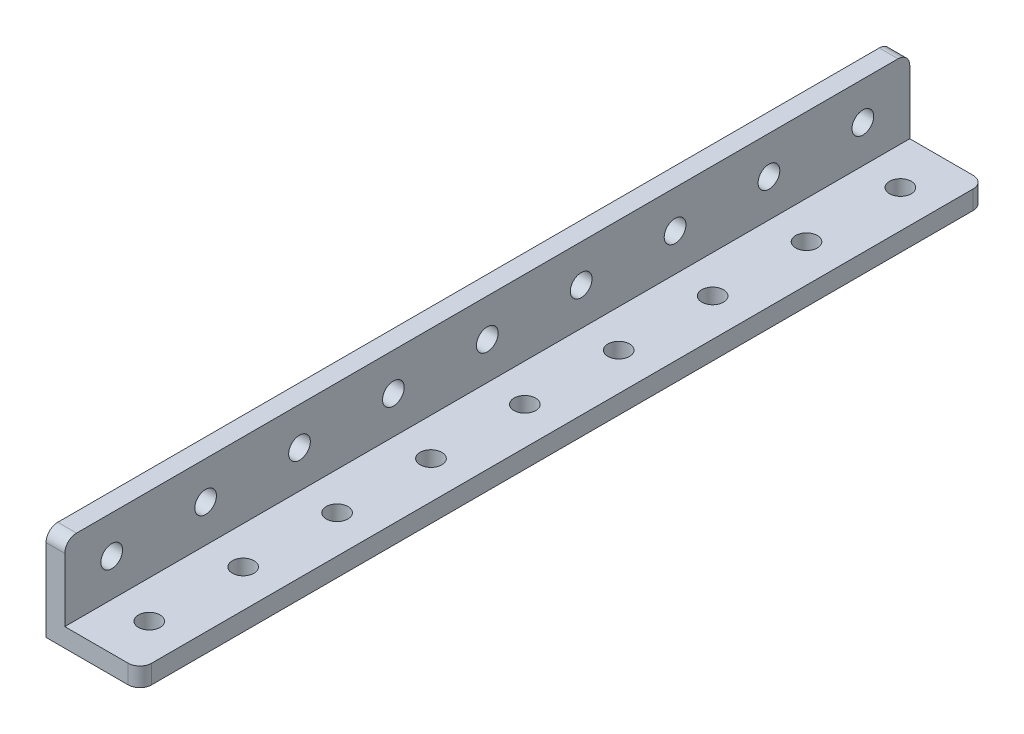
ISO-10303-21;
HEADER;
FILE_DESCRIPTION(('STEP AP214'),'2;1');
FILE_NAME('part.step','',(''),(''),'','','');
FILE_SCHEMA(('AUTOMOTIVE_DESIGN { 1 0 10303 214 1 1 1 1 }'));
ENDSEC;
DATA;
#1=APPLICATION_CONTEXT('core data for automotive mechanical design processes');
#2=APPLICATION_PROTOCOL_DEFINITION('international standard','automotive_design',2000,#1);
#3=PRODUCT_CONTEXT('',#1,'mechanical');
#4=PRODUCT('Part','Part','',(#3));
#5=PRODUCT_RELATED_PRODUCT_CATEGORY('part','',(#4));
#6=PRODUCT_DEFINITION_FORMATION('','',#4);
#7=PRODUCT_DEFINITION_CONTEXT('part definition',#1,'design');
#8=PRODUCT_DEFINITION('design','',#6,#7);
#9=PRODUCT_DEFINITION_SHAPE('','',#8);
#10=(LENGTH_UNIT() NAMED_UNIT(*) SI_UNIT(.MILLI.,.METRE.));
#11=(NAMED_UNIT(*) PLANE_ANGLE_UNIT() SI_UNIT($,.RADIAN.));
#12=(NAMED_UNIT(*) SI_UNIT($,.STERADIAN.) SOLID_ANGLE_UNIT());
#13=UNCERTAINTY_MEASURE_WITH_UNIT(LENGTH_MEASURE(1.E-05),#10,'distance_accuracy_value','');
#14=(GEOMETRIC_REPRESENTATION_CONTEXT(3) GLOBAL_UNCERTAINTY_ASSIGNED_CONTEXT((#13)) GLOBAL_UNIT_ASSIGNED_CONTEXT((#10,
#11,#12)) REPRESENTATION_CONTEXT('',''));
#15=CARTESIAN_POINT('',(0.,0.,0.));
#16=DIRECTION('',(0.,0.,1.));
#17=DIRECTION('',(1.,0.,0.));
#18=AXIS2_PLACEMENT_3D('',#15,#16,#17);
#19=CARTESIAN_POINT('',(16.,0.,0.));
#20=DIRECTION('',(1.,0.,0.));
#21=DIRECTION('',(0.,0.,-1.));
#22=AXIS2_PLACEMENT_3D('',#19,#20,#21);
#23=PLANE('',#22);
#24=DIRECTION('',(0.,0.,-1.));
#25=VECTOR('',#24,1.);
#26=CARTESIAN_POINT('',(16.,0.,0.));
#27=LINE('',#26,#25);
#28=CARTESIAN_POINT('',(16.,0.,-142.));
#29=VERTEX_POINT('',#28);
#30=CARTESIAN_POINT('',(16.,0.,-2.));
#31=VERTEX_POINT('',#30);
#32=EDGE_CURVE('E233',#29,#31,#27,.F.);
#33=ORIENTED_EDGE('',*,*,#32,.F.);
#34=DIRECTION('',(0.,-1.,0.));
#35=VECTOR('',#34,1.);
#36=CARTESIAN_POINT('',(16.,36.8576,-142.));
#37=LINE('',#36,#35);
#38=CARTESIAN_POINT('',(16.,3.2,-142.));
#39=VERTEX_POINT('',#38);
#40=EDGE_CURVE('E126',#39,#29,#37,.T.);
#41=ORIENTED_EDGE('',*,*,#40,.F.);
#42=DIRECTION('',(0.,0.,1.));
#43=VECTOR('',#42,1.);
#44=CARTESIAN_POINT('',(16.,3.2,0.));
#45=LINE('',#44,#43);
#46=CARTESIAN_POINT('',(16.,3.2,-2.));
#47=VERTEX_POINT('',#46);
#48=EDGE_CURVE('E123',#47,#39,#45,.F.);
#49=ORIENTED_EDGE('',*,*,#48,.F.);
#50=DIRECTION('',(0.,1.,0.));
#51=VECTOR('',#50,1.);
#52=CARTESIAN_POINT('',(16.,-20.8576,-2.));
#53=LINE('',#52,#51);
#54=EDGE_CURVE('E129',#31,#47,#53,.T.);
#55=ORIENTED_EDGE('',*,*,#54,.F.);
#56=EDGE_LOOP('',(#33,#41,#49,#55));
#57=FACE_BOUND('',#56,.T.);
#58=ADVANCED_FACE('F14',(#57),#23,.T.);
#59=CARTESIAN_POINT('',(14.,36.8576,-142.));
#60=DIRECTION('',(0.,-1.,0.));
#61=DIRECTION('',(0.,0.,-1.));
#62=AXIS2_PLACEMENT_3D('',#59,#60,#61);
#63=CYLINDRICAL_SURFACE('',#62,2.);
#64=ORIENTED_EDGE('',*,*,#40,.T.);
#65=CARTESIAN_POINT('',(14.,0.,-142.));
#66=DIRECTION('',(0.,-1.,0.));
#67=DIRECTION('',(0.,0.,-1.));
#68=AXIS2_PLACEMENT_3D('',#65,#66,#67);
#69=CIRCLE('',#68,2.);
#70=CARTESIAN_POINT('',(14.,0.,-144.));
#71=VERTEX_POINT('',#70);
#72=EDGE_CURVE('E227',#71,#29,#69,.T.);
#73=ORIENTED_EDGE('',*,*,#72,.F.);
#74=DIRECTION('',(0.,1.,0.));
#75=VECTOR('',#74,1.);
#76=CARTESIAN_POINT('',(14.,0.,-144.));
#77=LINE('',#76,#75);
#78=CARTESIAN_POINT('',(14.,3.2,-144.));
#79=VERTEX_POINT('',#78);
#80=EDGE_CURVE('E100',#71,#79,#77,.T.);
#81=ORIENTED_EDGE('',*,*,#80,.T.);
#82=CARTESIAN_POINT('',(14.,3.2,-142.));
#83=DIRECTION('',(0.,-1.,0.));
#84=DIRECTION('',(0.,0.,-1.));
#85=AXIS2_PLACEMENT_3D('',#82,#83,#84);
#86=CIRCLE('',#85,2.);
#87=EDGE_CURVE('E124',#39,#79,#86,.F.);
#88=ORIENTED_EDGE('',*,*,#87,.F.);
#89=EDGE_LOOP('',(#64,#73,#81,#88));
#90=FACE_BOUND('',#89,.T.);
#91=ADVANCED_FACE('F426',(#90),#63,.T.);
#92=CARTESIAN_POINT('',(9.6,3.2,-8.));
#93=DIRECTION('',(0.,-1.,0.));
#94=DIRECTION('',(0.,0.,-1.));
#95=AXIS2_PLACEMENT_3D('',#92,#93,#94);
#96=CYLINDRICAL_SURFACE('',#95,1.85);
#97=CARTESIAN_POINT('',(9.6,3.2,-8.));
#98=DIRECTION('',(0.,-1.,0.));
#99=DIRECTION('',(0.,0.,-1.));
#100=AXIS2_PLACEMENT_3D('',#97,#98,#99);
#101=CIRCLE('',#100,1.85);
#102=CARTESIAN_POINT('',(9.6,3.2,-9.85));
#103=VERTEX_POINT('',#102);
#104=EDGE_CURVE('E257',#103,#103,#101,.T.);
#105=ORIENTED_EDGE('',*,*,#104,.F.);
#106=EDGE_LOOP('',(#105));
#107=FACE_BOUND('',#106,.T.);
#108=CARTESIAN_POINT('',(9.6,0.,-8.));
#109=DIRECTION('',(0.,-1.,0.));
#110=DIRECTION('',(0.,0.,-1.));
#111=AXIS2_PLACEMENT_3D('',#108,#109,#110);
#112=CIRCLE('',#111,1.85);
#113=CARTESIAN_POINT('',(9.6,0.,-9.85));
#114=VERTEX_POINT('',#113);
#115=EDGE_CURVE('E224',#114,#114,#112,.F.);
#116=ORIENTED_EDGE('',*,*,#115,.F.);
#117=EDGE_LOOP('',(#116));
#118=FACE_BOUND('',#117,.T.);
#119=ADVANCED_FACE('F423',(#107,#118),#96,.F.);
#120=CARTESIAN_POINT('',(9.6,3.2,-24.));
#121=DIRECTION('',(0.,-1.,0.));
#122=DIRECTION('',(0.,0.,-1.));
#123=AXIS2_PLACEMENT_3D('',#120,#121,#122);
#124=CYLINDRICAL_SURFACE('',#123,1.85);
#125=CARTESIAN_POINT('',(9.6,3.2,-24.));
#126=DIRECTION('',(0.,-1.,0.));
#127=DIRECTION('',(0.,0.,-1.));
#128=AXIS2_PLACEMENT_3D('',#125,#126,#127);
#129=CIRCLE('',#128,1.85);
#130=CARTESIAN_POINT('',(9.6,3.2,-25.85));
#131=VERTEX_POINT('',#130);
#132=EDGE_CURVE('E254',#131,#131,#129,.T.);
#133=ORIENTED_EDGE('',*,*,#132,.F.);
#134=EDGE_LOOP('',(#133));
#135=FACE_BOUND('',#134,.T.);
#136=CARTESIAN_POINT('',(9.6,0.,-24.));
#137=DIRECTION('',(0.,-1.,0.));
#138=DIRECTION('',(0.,0.,-1.));
#139=AXIS2_PLACEMENT_3D('',#136,#137,#138);
#140=CIRCLE('',#139,1.85);
#141=CARTESIAN_POINT('',(9.6,0.,-25.85));
#142=VERTEX_POINT('',#141);
#143=EDGE_CURVE('E221',#142,#142,#140,.F.);
#144=ORIENTED_EDGE('',*,*,#143,.F.);
#145=EDGE_LOOP('',(#144));
#146=FACE_BOUND('',#145,.T.);
#147=ADVANCED_FACE('F419',(#135,#146),#124,.F.);
#148=CARTESIAN_POINT('',(9.6,3.2,-40.));
#149=DIRECTION('',(0.,-1.,0.));
#150=DIRECTION('',(0.,0.,-1.));
#151=AXIS2_PLACEMENT_3D('',#148,#149,#150);
#152=CYLINDRICAL_SURFACE('',#151,1.85);
#153=CARTESIAN_POINT('',(9.6,3.2,-40.));
#154=DIRECTION('',(0.,-1.,0.));
#155=DIRECTION('',(0.,0.,-1.));
#156=AXIS2_PLACEMENT_3D('',#153,#154,#155);
#157=CIRCLE('',#156,1.85);
#158=CARTESIAN_POINT('',(9.6,3.2,-41.85));
#159=VERTEX_POINT('',#158);
#160=EDGE_CURVE('E251',#159,#159,#157,.T.);
#161=ORIENTED_EDGE('',*,*,#160,.F.);
#162=EDGE_LOOP('',(#161));
#163=FACE_BOUND('',#162,.T.);
#164=CARTESIAN_POINT('',(9.6,0.,-40.));
#165=DIRECTION('',(0.,-1.,0.));
#166=DIRECTION('',(0.,0.,-1.));
#167=AXIS2_PLACEMENT_3D('',#164,#165,#166);
#168=CIRCLE('',#167,1.85);
#169=CARTESIAN_POINT('',(9.6,0.,-41.85));
#170=VERTEX_POINT('',#169);
#171=EDGE_CURVE('E218',#170,#170,#168,.F.);
#172=ORIENTED_EDGE('',*,*,#171,.F.);
#173=EDGE_LOOP('',(#172));
#174=FACE_BOUND('',#173,.T.);
#175=ADVANCED_FACE('F415',(#163,#174),#152,.F.);
#176=CARTESIAN_POINT('',(9.6,3.2,-56.));
#177=DIRECTION('',(0.,-1.,0.));
#178=DIRECTION('',(0.,0.,-1.));
#179=AXIS2_PLACEMENT_3D('',#176,#177,#178);
#180=CYLINDRICAL_SURFACE('',#179,1.85);
#181=CARTESIAN_POINT('',(9.6,3.2,-56.));
#182=DIRECTION('',(0.,-1.,0.));
#183=DIRECTION('',(0.,0.,-1.));
#184=AXIS2_PLACEMENT_3D('',#181,#182,#183);
#185=CIRCLE('',#184,1.85);
#186=CARTESIAN_POINT('',(9.6,3.2,-57.85));
#187=VERTEX_POINT('',#186);
#188=EDGE_CURVE('E248',#187,#187,#185,.T.);
#189=ORIENTED_EDGE('',*,*,#188,.F.);
#190=EDGE_LOOP('',(#189));
#191=FACE_BOUND('',#190,.T.);
#192=CARTESIAN_POINT('',(9.6,0.,-56.));
#193=DIRECTION('',(0.,-1.,0.));
#194=DIRECTION('',(0.,0.,-1.));
#195=AXIS2_PLACEMENT_3D('',#192,#193,#194);
#196=CIRCLE('',#195,1.85);
#197=CARTESIAN_POINT('',(9.6,0.,-57.85));
#198=VERTEX_POINT('',#197);
#199=EDGE_CURVE('E215',#198,#198,#196,.F.);
#200=ORIENTED_EDGE('',*,*,#199,.F.);
#201=EDGE_LOOP('',(#200));
#202=FACE_BOUND('',#201,.T.);
#203=ADVANCED_FACE('F411',(#191,#202),#180,.F.);
#204=CARTESIAN_POINT('',(9.6,3.2,-72.));
#205=DIRECTION('',(0.,-1.,0.));
#206=DIRECTION('',(0.,0.,-1.));
#207=AXIS2_PLACEMENT_3D('',#204,#205,#206);
#208=CYLINDRICAL_SURFACE('',#207,1.85);
#209=CARTESIAN_POINT('',(9.6,3.2,-72.));
#210=DIRECTION('',(0.,-1.,0.));
#211=DIRECTION('',(0.,0.,-1.));
#212=AXIS2_PLACEMENT_3D('',#209,#210,#211);
#213=CIRCLE('',#212,1.85);
#214=CARTESIAN_POINT('',(9.6,3.2,-73.85));
#215=VERTEX_POINT('',#214);
#216=EDGE_CURVE('E245',#215,#215,#213,.T.);
#217=ORIENTED_EDGE('',*,*,#216,.F.);
#218=EDGE_LOOP('',(#217));
#219=FACE_BOUND('',#218,.T.);
#220=CARTESIAN_POINT('',(9.6,0.,-72.));
#221=DIRECTION('',(0.,-1.,0.));
#222=DIRECTION('',(0.,0.,-1.));
#223=AXIS2_PLACEMENT_3D('',#220,#221,#222);
#224=CIRCLE('',#223,1.85);
#225=CARTESIAN_POINT('',(9.6,0.,-73.85));
#226=VERTEX_POINT('',#225);
#227=EDGE_CURVE('E212',#226,#226,#224,.F.);
#228=ORIENTED_EDGE('',*,*,#227,.F.);
#229=EDGE_LOOP('',(#228));
#230=FACE_BOUND('',#229,.T.);
#231=ADVANCED_FACE('F407',(#219,#230),#208,.F.);
#232=CARTESIAN_POINT('',(9.6,3.2,-88.));
#233=DIRECTION('',(0.,-1.,0.));
#234=DIRECTION('',(0.,0.,-1.));
#235=AXIS2_PLACEMENT_3D('',#232,#233,#234);
#236=CYLINDRICAL_SURFACE('',#235,1.85);
#237=CARTESIAN_POINT('',(9.6,3.2,-88.));
#238=DIRECTION('',(0.,-1.,0.));
#239=DIRECTION('',(0.,0.,-1.));
#240=AXIS2_PLACEMENT_3D('',#237,#238,#239);
#241=CIRCLE('',#240,1.85);
#242=CARTESIAN_POINT('',(9.6,3.2,-89.85));
#243=VERTEX_POINT('',#242);
#244=EDGE_CURVE('E242',#243,#243,#241,.T.);
#245=ORIENTED_EDGE('',*,*,#244,.F.);
#246=EDGE_LOOP('',(#245));
#247=FACE_BOUND('',#246,.T.);
#248=CARTESIAN_POINT('',(9.6,0.,-88.));
#249=DIRECTION('',(0.,-1.,0.));
#250=DIRECTION('',(0.,0.,-1.));
#251=AXIS2_PLACEMENT_3D('',#248,#249,#250);
#252=CIRCLE('',#251,1.85);
#253=CARTESIAN_POINT('',(9.6,0.,-89.85));
#254=VERTEX_POINT('',#253);
#255=EDGE_CURVE('E209',#254,#254,#252,.F.);
#256=ORIENTED_EDGE('',*,*,#255,.F.);
#257=EDGE_LOOP('',(#256));
#258=FACE_BOUND('',#257,.T.);
#259=ADVANCED_FACE('F403',(#247,#258),#236,.F.);
#260=CARTESIAN_POINT('',(9.6,3.2,-104.));
#261=DIRECTION('',(0.,-1.,0.));
#262=DIRECTION('',(0.,0.,-1.));
#263=AXIS2_PLACEMENT_3D('',#260,#261,#262);
#264=CYLINDRICAL_SURFACE('',#263,1.85);
#265=CARTESIAN_POINT('',(9.6,3.2,-104.));
#266=DIRECTION('',(0.,-1.,0.));
#267=DIRECTION('',(0.,0.,-1.));
#268=AXIS2_PLACEMENT_3D('',#265,#266,#267);
#269=CIRCLE('',#268,1.85);
#270=CARTESIAN_POINT('',(9.6,3.2,-105.85));
#271=VERTEX_POINT('',#270);
#272=EDGE_CURVE('E239',#271,#271,#269,.T.);
#273=ORIENTED_EDGE('',*,*,#272,.F.);
#274=EDGE_LOOP('',(#273));
#275=FACE_BOUND('',#274,.T.);
#276=CARTESIAN_POINT('',(9.6,0.,-104.));
#277=DIRECTION('',(0.,-1.,0.));
#278=DIRECTION('',(0.,0.,-1.));
#279=AXIS2_PLACEMENT_3D('',#276,#277,#278);
#280=CIRCLE('',#279,1.85);
#281=CARTESIAN_POINT('',(9.6,0.,-105.85));
#282=VERTEX_POINT('',#281);
#283=EDGE_CURVE('E206',#282,#282,#280,.F.);
#284=ORIENTED_EDGE('',*,*,#283,.F.);
#285=EDGE_LOOP('',(#284));
#286=FACE_BOUND('',#285,.T.);
#287=ADVANCED_FACE('F399',(#275,#286),#264,.F.);
#288=CARTESIAN_POINT('',(9.6,3.2,-120.));
#289=DIRECTION('',(0.,-1.,0.));
#290=DIRECTION('',(0.,0.,-1.));
#291=AXIS2_PLACEMENT_3D('',#288,#289,#290);
#292=CYLINDRICAL_SURFACE('',#291,1.85);
#293=CARTESIAN_POINT('',(9.6,3.2,-120.));
#294=DIRECTION('',(0.,-1.,0.));
#295=DIRECTION('',(0.,0.,-1.));
#296=AXIS2_PLACEMENT_3D('',#293,#294,#295);
#297=CIRCLE('',#296,1.85);
#298=CARTESIAN_POINT('',(9.6,3.2,-121.85));
#299=VERTEX_POINT('',#298);
#300=EDGE_CURVE('E236',#299,#299,#297,.T.);
#301=ORIENTED_EDGE('',*,*,#300,.F.);
#302=EDGE_LOOP('',(#301));
#303=FACE_BOUND('',#302,.T.);
#304=CARTESIAN_POINT('',(9.6,0.,-120.));
#305=DIRECTION('',(0.,-1.,0.));
#306=DIRECTION('',(0.,0.,-1.));
#307=AXIS2_PLACEMENT_3D('',#304,#305,#306);
#308=CIRCLE('',#307,1.85);
#309=CARTESIAN_POINT('',(9.6,0.,-121.85));
#310=VERTEX_POINT('',#309);
#311=EDGE_CURVE('E203',#310,#310,#308,.F.);
#312=ORIENTED_EDGE('',*,*,#311,.F.);
#313=EDGE_LOOP('',(#312));
#314=FACE_BOUND('',#313,.T.);
#315=ADVANCED_FACE('F395',(#303,#314),#292,.F.);
#316=CARTESIAN_POINT('',(9.6,3.2,-136.));
#317=DIRECTION('',(0.,-1.,0.));
#318=DIRECTION('',(0.,0.,-1.));
#319=AXIS2_PLACEMENT_3D('',#316,#317,#318);
#320=CYLINDRICAL_SURFACE('',#319,1.85);
#321=CARTESIAN_POINT('',(9.6,3.2,-136.));
#322=DIRECTION('',(0.,-1.,0.));
#323=DIRECTION('',(0.,0.,-1.));
#324=AXIS2_PLACEMENT_3D('',#321,#322,#323);
#325=CIRCLE('',#324,1.85);
#326=CARTESIAN_POINT('',(9.6,3.2,-137.85));
#327=VERTEX_POINT('',#326);
#328=EDGE_CURVE('E101',#327,#327,#325,.T.);
#329=ORIENTED_EDGE('',*,*,#328,.F.);
#330=EDGE_LOOP('',(#329));
#331=FACE_BOUND('',#330,.T.);
#332=CARTESIAN_POINT('',(9.6,0.,-136.));
#333=DIRECTION('',(0.,-1.,0.));
#334=DIRECTION('',(0.,0.,-1.));
#335=AXIS2_PLACEMENT_3D('',#332,#333,#334);
#336=CIRCLE('',#335,1.85);
#337=CARTESIAN_POINT('',(9.6,0.,-137.85));
#338=VERTEX_POINT('',#337);
#339=EDGE_CURVE('E200',#338,#338,#336,.F.);
#340=ORIENTED_EDGE('',*,*,#339,.F.);
#341=EDGE_LOOP('',(#340));
#342=FACE_BOUND('',#341,.T.);
#343=ADVANCED_FACE('F392',(#331,#342),#320,.F.);
#344=CARTESIAN_POINT('',(14.,-20.8576,-2.));
#345=DIRECTION('',(0.,1.,0.));
#346=DIRECTION('',(0.,0.,1.));
#347=AXIS2_PLACEMENT_3D('',#344,#345,#346);
#348=CYLINDRICAL_SURFACE('',#347,2.);
#349=ORIENTED_EDGE('',*,*,#54,.T.);
#350=CARTESIAN_POINT('',(14.,3.2,-2.));
#351=DIRECTION('',(0.,1.,0.));
#352=DIRECTION('',(0.,0.,1.));
#353=AXIS2_PLACEMENT_3D('',#350,#351,#352);
#354=CIRCLE('',#353,2.);
#355=CARTESIAN_POINT('',(14.,3.2,0.));
#356=VERTEX_POINT('',#355);
#357=EDGE_CURVE('E17',#356,#47,#354,.T.);
#358=ORIENTED_EDGE('',*,*,#357,.F.);
#359=DIRECTION('',(0.,1.,0.));
#360=VECTOR('',#359,1.);
#361=CARTESIAN_POINT('',(14.,0.,0.));
#362=LINE('',#361,#360);
#363=CARTESIAN_POINT('',(14.,0.,0.));
#364=VERTEX_POINT('',#363);
#365=EDGE_CURVE('E114',#364,#356,#362,.T.);
#366=ORIENTED_EDGE('',*,*,#365,.F.);
#367=CARTESIAN_POINT('',(14.,0.,-2.));
#368=DIRECTION('',(0.,1.,0.));
#369=DIRECTION('',(0.,0.,1.));
#370=AXIS2_PLACEMENT_3D('',#367,#368,#369);
#371=CIRCLE('',#370,2.);
#372=EDGE_CURVE('E231',#31,#364,#371,.F.);
#373=ORIENTED_EDGE('',*,*,#372,.F.);
#374=EDGE_LOOP('',(#349,#358,#366,#373));
#375=FACE_BOUND('',#374,.T.);
#376=ADVANCED_FACE('F384',(#375),#348,.T.);
#377=CARTESIAN_POINT('',(16.,3.2,0.));
#378=DIRECTION('',(0.,1.,0.));
#379=DIRECTION('',(0.,0.,1.));
#380=AXIS2_PLACEMENT_3D('',#377,#378,#379);
#381=PLANE('',#380);
#382=ORIENTED_EDGE('',*,*,#328,.T.);
#383=EDGE_LOOP('',(#382));
#384=FACE_BOUND('',#383,.T.);
#385=ORIENTED_EDGE('',*,*,#300,.T.);
#386=EDGE_LOOP('',(#385));
#387=FACE_BOUND('',#386,.T.);
#388=ORIENTED_EDGE('',*,*,#272,.T.);
#389=EDGE_LOOP('',(#388));
#390=FACE_BOUND('',#389,.T.);
#391=ORIENTED_EDGE('',*,*,#244,.T.);
#392=EDGE_LOOP('',(#391));
#393=FACE_BOUND('',#392,.T.);
#394=ORIENTED_EDGE('',*,*,#216,.T.);
#395=EDGE_LOOP('',(#394));
#396=FACE_BOUND('',#395,.T.);
#397=ORIENTED_EDGE('',*,*,#188,.T.);
#398=EDGE_LOOP('',(#397));
#399=FACE_BOUND('',#398,.T.);
#400=ORIENTED_EDGE('',*,*,#160,.T.);
#401=EDGE_LOOP('',(#400));
#402=FACE_BOUND('',#401,.T.);
#403=ORIENTED_EDGE('',*,*,#132,.T.);
#404=EDGE_LOOP('',(#403));
#405=FACE_BOUND('',#404,.T.);
#406=ORIENTED_EDGE('',*,*,#104,.T.);
#407=EDGE_LOOP('',(#406));
#408=FACE_BOUND('',#407,.T.);
#409=ORIENTED_EDGE('',*,*,#48,.T.);
#410=ORIENTED_EDGE('',*,*,#87,.T.);
#411=DIRECTION('',(1.,0.,0.));
#412=VECTOR('',#411,1.);
#413=CARTESIAN_POINT('',(0.,3.2,-144.));
#414=LINE('',#413,#412);
#415=CARTESIAN_POINT('',(3.2,3.2,-144.));
#416=VERTEX_POINT('',#415);
#417=EDGE_CURVE('E97',#79,#416,#414,.F.);
#418=ORIENTED_EDGE('',*,*,#417,.T.);
#419=DIRECTION('',(0.,0.,-1.));
#420=VECTOR('',#419,1.);
#421=CARTESIAN_POINT('',(3.2,3.2,0.));
#422=LINE('',#421,#420);
#423=CARTESIAN_POINT('',(3.2,3.2,0.));
#424=VERTEX_POINT('',#423);
#425=EDGE_CURVE('E88',#424,#416,#422,.T.);
#426=ORIENTED_EDGE('',*,*,#425,.F.);
#427=DIRECTION('',(1.,0.,0.));
#428=VECTOR('',#427,1.);
#429=CARTESIAN_POINT('',(0.,3.2,0.));
#430=LINE('',#429,#428);
#431=EDGE_CURVE('E93',#356,#424,#430,.F.);
#432=ORIENTED_EDGE('',*,*,#431,.F.);
#433=ORIENTED_EDGE('',*,*,#357,.T.);
#434=EDGE_LOOP('',(#409,#410,#418,#426,#432,#433));
#435=FACE_BOUND('',#434,.T.);
#436=ADVANCED_FACE('F91',(#384,#387,#390,#393,#396,#399,#402,#405,#408,#435),#381,.T.);
#437=CARTESIAN_POINT('',(3.2,3.2,0.));
#438=DIRECTION('',(1.,0.,0.));
#439=DIRECTION('',(0.,0.,-1.));
#440=AXIS2_PLACEMENT_3D('',#437,#438,#439);
#441=PLANE('',#440);
#442=CARTESIAN_POINT('',(3.2,9.6,-136.));
#443=DIRECTION('',(-1.,0.,0.));
#444=DIRECTION('',(0.,0.,1.));
#445=AXIS2_PLACEMENT_3D('',#442,#443,#444);
#446=CIRCLE('',#445,1.85);
#447=CARTESIAN_POINT('',(3.2,9.6,-134.15));
#448=VERTEX_POINT('',#447);
#449=EDGE_CURVE('E167',#448,#448,#446,.T.);
#450=ORIENTED_EDGE('',*,*,#449,.T.);
#451=EDGE_LOOP('',(#450));
#452=FACE_BOUND('',#451,.T.);
#453=CARTESIAN_POINT('',(3.2,9.6,-120.));
#454=DIRECTION('',(-1.,0.,0.));
#455=DIRECTION('',(0.,0.,1.));
#456=AXIS2_PLACEMENT_3D('',#453,#454,#455);
#457=CIRCLE('',#456,1.85);
#458=CARTESIAN_POINT('',(3.2,9.6,-118.15));
#459=VERTEX_POINT('',#458);
#460=EDGE_CURVE('E171',#459,#459,#457,.T.);
#461=ORIENTED_EDGE('',*,*,#460,.T.);
#462=EDGE_LOOP('',(#461));
#463=FACE_BOUND('',#462,.T.);
#464=CARTESIAN_POINT('',(3.2,9.6,-104.));
#465=DIRECTION('',(-1.,0.,0.));
#466=DIRECTION('',(0.,0.,1.));
#467=AXIS2_PLACEMENT_3D('',#464,#465,#466);
#468=CIRCLE('',#467,1.85);
#469=CARTESIAN_POINT('',(3.2,9.6,-102.15));
#470=VERTEX_POINT('',#469);
#471=EDGE_CURVE('E174',#470,#470,#468,.T.);
#472=ORIENTED_EDGE('',*,*,#471,.T.);
#473=EDGE_LOOP('',(#472));
#474=FACE_BOUND('',#473,.T.);
#475=CARTESIAN_POINT('',(3.2,9.6,-88.));
#476=DIRECTION('',(-1.,0.,0.));
#477=DIRECTION('',(0.,0.,1.));
#478=AXIS2_PLACEMENT_3D('',#475,#476,#477);
#479=CIRCLE('',#478,1.85);
#480=CARTESIAN_POINT('',(3.2,9.6,-86.15));
#481=VERTEX_POINT('',#480);
#482=EDGE_CURVE('E177',#481,#481,#479,.T.);
#483=ORIENTED_EDGE('',*,*,#482,.T.);
#484=EDGE_LOOP('',(#483));
#485=FACE_BOUND('',#484,.T.);
#486=CARTESIAN_POINT('',(3.2,9.6,-72.));
#487=DIRECTION('',(-1.,0.,0.));
#488=DIRECTION('',(0.,0.,1.));
#489=AXIS2_PLACEMENT_3D('',#486,#487,#488);
#490=CIRCLE('',#489,1.85);
#491=CARTESIAN_POINT('',(3.2,9.6,-70.15));
#492=VERTEX_POINT('',#491);
#493=EDGE_CURVE('E180',#492,#492,#490,.T.);
#494=ORIENTED_EDGE('',*,*,#493,.T.);
#495=EDGE_LOOP('',(#494));
#496=FACE_BOUND('',#495,.T.);
#497=CARTESIAN_POINT('',(3.2,9.6,-56.));
#498=DIRECTION('',(-1.,0.,0.));
#499=DIRECTION('',(0.,0.,1.));
#500=AXIS2_PLACEMENT_3D('',#497,#498,#499);
#501=CIRCLE('',#500,1.85);
#502=CARTESIAN_POINT('',(3.2,9.6,-54.15));
#503=VERTEX_POINT('',#502);
#504=EDGE_CURVE('E183',#503,#503,#501,.T.);
#505=ORIENTED_EDGE('',*,*,#504,.T.);
#506=EDGE_LOOP('',(#505));
#507=FACE_BOUND('',#506,.T.);
#508=CARTESIAN_POINT('',(3.2,9.6,-40.));
#509=DIRECTION('',(-1.,0.,0.));
#510=DIRECTION('',(0.,0.,1.));
#511=AXIS2_PLACEMENT_3D('',#508,#509,#510);
#512=CIRCLE('',#511,1.85);
#513=CARTESIAN_POINT('',(3.2,9.6,-38.15));
#514=VERTEX_POINT('',#513);
#515=EDGE_CURVE('E186',#514,#514,#512,.T.);
#516=ORIENTED_EDGE('',*,*,#515,.T.);
#517=EDGE_LOOP('',(#516));
#518=FACE_BOUND('',#517,.T.);
#519=CARTESIAN_POINT('',(3.2,9.6,-24.));
#520=DIRECTION('',(-1.,0.,0.));
#521=DIRECTION('',(0.,0.,1.));
#522=AXIS2_PLACEMENT_3D('',#519,#520,#521);
#523=CIRCLE('',#522,1.85);
#524=CARTESIAN_POINT('',(3.2,9.6,-22.15));
#525=VERTEX_POINT('',#524);
#526=EDGE_CURVE('E189',#525,#525,#523,.T.);
#527=ORIENTED_EDGE('',*,*,#526,.T.);
#528=EDGE_LOOP('',(#527));
#529=FACE_BOUND('',#528,.T.);
#530=CARTESIAN_POINT('',(3.2,9.6,-8.));
#531=DIRECTION('',(-1.,0.,0.));
#532=DIRECTION('',(0.,0.,1.));
#533=AXIS2_PLACEMENT_3D('',#530,#531,#532);
#534=CIRCLE('',#533,1.85);
#535=CARTESIAN_POINT('',(3.2,9.6,-6.15));
#536=VERTEX_POINT('',#535);
#537=EDGE_CURVE('E192',#536,#536,#534,.T.);
#538=ORIENTED_EDGE('',*,*,#537,.T.);
#539=EDGE_LOOP('',(#538));
#540=FACE_BOUND('',#539,.T.);
#541=DIRECTION('',(0.,1.,0.));
#542=VECTOR('',#541,1.);
#543=CARTESIAN_POINT('',(3.2,0.,-144.));
#544=LINE('',#543,#542);
#545=CARTESIAN_POINT('',(3.2,14.,-144.));
#546=VERTEX_POINT('',#545);
#547=EDGE_CURVE('E133',#416,#546,#544,.T.);
#548=ORIENTED_EDGE('',*,*,#547,.T.);
#549=CARTESIAN_POINT('',(3.2,14.,-142.));
#550=DIRECTION('',(1.,0.,0.));
#551=DIRECTION('',(0.,0.,-1.));
#552=AXIS2_PLACEMENT_3D('',#549,#550,#551);
#553=CIRCLE('',#552,2.);
#554=CARTESIAN_POINT('',(3.2,16.,-142.));
#555=VERTEX_POINT('',#554);
#556=EDGE_CURVE('E195',#555,#546,#553,.F.);
#557=ORIENTED_EDGE('',*,*,#556,.F.);
#558=DIRECTION('',(0.,0.,1.));
#559=VECTOR('',#558,1.);
#560=CARTESIAN_POINT('',(3.2,16.,0.));
#561=LINE('',#560,#559);
#562=CARTESIAN_POINT('',(3.2,16.,-2.));
#563=VERTEX_POINT('',#562);
#564=EDGE_CURVE('E275',#563,#555,#561,.F.);
#565=ORIENTED_EDGE('',*,*,#564,.F.);
#566=CARTESIAN_POINT('',(3.2,14.,-2.));
#567=DIRECTION('',(-1.,0.,0.));
#568=DIRECTION('',(0.,0.,1.));
#569=AXIS2_PLACEMENT_3D('',#566,#567,#568);
#570=CIRCLE('',#569,2.);
#571=CARTESIAN_POINT('',(3.2,14.,0.));
#572=VERTEX_POINT('',#571);
#573=EDGE_CURVE('E107',#572,#563,#570,.T.);
#574=ORIENTED_EDGE('',*,*,#573,.F.);
#575=DIRECTION('',(0.,1.,0.));
#576=VECTOR('',#575,1.);
#577=CARTESIAN_POINT('',(3.2,0.,0.));
#578=LINE('',#577,#576);
#579=EDGE_CURVE('E104',#424,#572,#578,.T.);
#580=ORIENTED_EDGE('',*,*,#579,.F.);
#581=ORIENTED_EDGE('',*,*,#425,.T.);
#582=EDGE_LOOP('',(#548,#557,#565,#574,#580,#581));
#583=FACE_BOUND('',#582,.T.);
#584=ADVANCED_FACE('F105',(#452,#463,#474,#485,#496,#507,#518,#529,#540,#583),#441,.T.);
#585=CARTESIAN_POINT('',(0.,0.,-144.));
#586=DIRECTION('',(0.,0.,1.));
#587=DIRECTION('',(1.,0.,0.));
#588=AXIS2_PLACEMENT_3D('',#585,#586,#587);
#589=PLANE('',#588);
#590=ORIENTED_EDGE('',*,*,#417,.F.);
#591=ORIENTED_EDGE('',*,*,#80,.F.);
#592=DIRECTION('',(1.,0.,0.));
#593=VECTOR('',#592,1.);
#594=CARTESIAN_POINT('',(0.,0.,-144.));
#595=LINE('',#594,#593);
#596=CARTESIAN_POINT('',(0.,0.,-144.));
#597=VERTEX_POINT('',#596);
#598=EDGE_CURVE('E230',#597,#71,#595,.T.);
#599=ORIENTED_EDGE('',*,*,#598,.F.);
#600=DIRECTION('',(0.,1.,0.));
#601=VECTOR('',#600,1.);
#602=CARTESIAN_POINT('',(0.,16.,-144.));
#603=LINE('',#602,#601);
#604=CARTESIAN_POINT('',(0.,14.,-144.));
#605=VERTEX_POINT('',#604);
#606=EDGE_CURVE('E170',#605,#597,#603,.F.);
#607=ORIENTED_EDGE('',*,*,#606,.F.);
#608=DIRECTION('',(1.,0.,0.));
#609=VECTOR('',#608,1.);
#610=CARTESIAN_POINT('',(-20.8576,14.,-144.));
#611=LINE('',#610,#609);
#612=EDGE_CURVE('E268',#546,#605,#611,.F.);
#613=ORIENTED_EDGE('',*,*,#612,.F.);
#614=ORIENTED_EDGE('',*,*,#547,.F.);
#615=EDGE_LOOP('',(#590,#591,#599,#607,#613,#614));
#616=FACE_BOUND('',#615,.T.);
#617=ADVANCED_FACE('F263',(#616),#589,.F.);
#618=CARTESIAN_POINT('',(0.,0.,0.));
#619=DIRECTION('',(0.,-1.,0.));
#620=DIRECTION('',(0.,0.,-1.));
#621=AXIS2_PLACEMENT_3D('',#618,#619,#620);
#622=PLANE('',#621);
#623=ORIENTED_EDGE('',*,*,#339,.T.);
#624=EDGE_LOOP('',(#623));
#625=FACE_BOUND('',#624,.T.);
#626=ORIENTED_EDGE('',*,*,#311,.T.);
#627=EDGE_LOOP('',(#626));
#628=FACE_BOUND('',#627,.T.);
#629=ORIENTED_EDGE('',*,*,#283,.T.);
#630=EDGE_LOOP('',(#629));
#631=FACE_BOUND('',#630,.T.);
#632=ORIENTED_EDGE('',*,*,#255,.T.);
#633=EDGE_LOOP('',(#632));
#634=FACE_BOUND('',#633,.T.);
#635=ORIENTED_EDGE('',*,*,#227,.T.);
#636=EDGE_LOOP('',(#635));
#637=FACE_BOUND('',#636,.T.);
#638=ORIENTED_EDGE('',*,*,#199,.T.);
#639=EDGE_LOOP('',(#638));
#640=FACE_BOUND('',#639,.T.);
#641=ORIENTED_EDGE('',*,*,#171,.T.);
#642=EDGE_LOOP('',(#641));
#643=FACE_BOUND('',#642,.T.);
#644=ORIENTED_EDGE('',*,*,#143,.T.);
#645=EDGE_LOOP('',(#644));
#646=FACE_BOUND('',#645,.T.);
#647=ORIENTED_EDGE('',*,*,#115,.T.);
#648=EDGE_LOOP('',(#647));
#649=FACE_BOUND('',#648,.T.);
#650=ORIENTED_EDGE('',*,*,#598,.T.);
#651=ORIENTED_EDGE('',*,*,#72,.T.);
#652=ORIENTED_EDGE('',*,*,#32,.T.);
#653=ORIENTED_EDGE('',*,*,#372,.T.);
#654=DIRECTION('',(1.,0.,0.));
#655=VECTOR('',#654,1.);
#656=CARTESIAN_POINT('',(0.,0.,0.));
#657=LINE('',#656,#655);
#658=CARTESIAN_POINT('',(0.,0.,0.));
#659=VERTEX_POINT('',#658);
#660=EDGE_CURVE('E116',#659,#364,#657,.T.);
#661=ORIENTED_EDGE('',*,*,#660,.F.);
#662=DIRECTION('',(0.,0.,1.));
#663=VECTOR('',#662,1.);
#664=CARTESIAN_POINT('',(0.,0.,0.));
#665=LINE('',#664,#663);
#666=EDGE_CURVE('E286',#597,#659,#665,.T.);
#667=ORIENTED_EDGE('',*,*,#666,.F.);
#668=EDGE_LOOP('',(#650,#651,#652,#653,#661,#667));
#669=FACE_BOUND('',#668,.T.);
#670=ADVANCED_FACE('F382',(#625,#628,#631,#634,#637,#640,#643,#646,#649,#669),#622,.T.);
#671=CARTESIAN_POINT('',(0.,0.,0.));
#672=DIRECTION('',(0.,0.,1.));
#673=DIRECTION('',(1.,0.,0.));
#674=AXIS2_PLACEMENT_3D('',#671,#672,#673);
#675=PLANE('',#674);
#676=ORIENTED_EDGE('',*,*,#579,.T.);
#677=DIRECTION('',(-1.,0.,0.));
#678=VECTOR('',#677,1.);
#679=CARTESIAN_POINT('',(36.8576,14.,0.));
#680=LINE('',#679,#678);
#681=CARTESIAN_POINT('',(0.,14.,0.));
#682=VERTEX_POINT('',#681);
#683=EDGE_CURVE('E110',#682,#572,#680,.F.);
#684=ORIENTED_EDGE('',*,*,#683,.F.);
#685=DIRECTION('',(0.,1.,0.));
#686=VECTOR('',#685,1.);
#687=CARTESIAN_POINT('',(0.,16.,0.));
#688=LINE('',#687,#686);
#689=EDGE_CURVE('E166',#659,#682,#688,.T.);
#690=ORIENTED_EDGE('',*,*,#689,.F.);
#691=ORIENTED_EDGE('',*,*,#660,.T.);
#692=ORIENTED_EDGE('',*,*,#365,.T.);
#693=ORIENTED_EDGE('',*,*,#431,.T.);
#694=EDGE_LOOP('',(#676,#684,#690,#691,#692,#693));
#695=FACE_BOUND('',#694,.T.);
#696=ADVANCED_FACE('F112',(#695),#675,.T.);
#697=CARTESIAN_POINT('',(36.8576,14.,-2.));
#698=DIRECTION('',(-1.,0.,0.));
#699=DIRECTION('',(0.,0.,1.));
#700=AXIS2_PLACEMENT_3D('',#697,#698,#699);
#701=CYLINDRICAL_SURFACE('',#700,2.);
#702=DIRECTION('',(1.,0.,0.));
#703=VECTOR('',#702,1.);
#704=CARTESIAN_POINT('',(3.2,16.,-2.));
#705=LINE('',#704,#703);
#706=CARTESIAN_POINT('',(0.,16.,-2.));
#707=VERTEX_POINT('',#706);
#708=EDGE_CURVE('E199',#707,#563,#705,.T.);
#709=ORIENTED_EDGE('',*,*,#708,.F.);
#710=CARTESIAN_POINT('',(0.,14.,-2.));
#711=DIRECTION('',(-1.,0.,0.));
#712=DIRECTION('',(0.,0.,1.));
#713=AXIS2_PLACEMENT_3D('',#710,#711,#712);
#714=CIRCLE('',#713,2.);
#715=EDGE_CURVE('E163',#682,#707,#714,.T.);
#716=ORIENTED_EDGE('',*,*,#715,.F.);
#717=ORIENTED_EDGE('',*,*,#683,.T.);
#718=ORIENTED_EDGE('',*,*,#573,.T.);
#719=EDGE_LOOP('',(#709,#716,#717,#718));
#720=FACE_BOUND('',#719,.T.);
#721=ADVANCED_FACE('F311',(#720),#701,.T.);
#722=CARTESIAN_POINT('',(3.2,16.,0.));
#723=DIRECTION('',(0.,1.,0.));
#724=DIRECTION('',(0.,0.,1.));
#725=AXIS2_PLACEMENT_3D('',#722,#723,#724);
#726=PLANE('',#725);
#727=ORIENTED_EDGE('',*,*,#564,.T.);
#728=DIRECTION('',(1.,0.,0.));
#729=VECTOR('',#728,1.);
#730=CARTESIAN_POINT('',(-20.8576,16.,-142.));
#731=LINE('',#730,#729);
#732=CARTESIAN_POINT('',(0.,16.,-142.));
#733=VERTEX_POINT('',#732);
#734=EDGE_CURVE('E32',#733,#555,#731,.T.);
#735=ORIENTED_EDGE('',*,*,#734,.F.);
#736=DIRECTION('',(0.,0.,1.));
#737=VECTOR('',#736,1.);
#738=CARTESIAN_POINT('',(0.,16.,0.));
#739=LINE('',#738,#737);
#740=EDGE_CURVE('E162',#707,#733,#739,.F.);
#741=ORIENTED_EDGE('',*,*,#740,.F.);
#742=ORIENTED_EDGE('',*,*,#708,.T.);
#743=EDGE_LOOP('',(#727,#735,#741,#742));
#744=FACE_BOUND('',#743,.T.);
#745=ADVANCED_FACE('F309',(#744),#726,.T.);
#746=CARTESIAN_POINT('',(-20.8576,14.,-142.));
#747=DIRECTION('',(1.,0.,0.));
#748=DIRECTION('',(0.,0.,-1.));
#749=AXIS2_PLACEMENT_3D('',#746,#747,#748);
#750=CYLINDRICAL_SURFACE('',#749,2.);
#751=ORIENTED_EDGE('',*,*,#734,.T.);
#752=ORIENTED_EDGE('',*,*,#556,.T.);
#753=ORIENTED_EDGE('',*,*,#612,.T.);
#754=CARTESIAN_POINT('',(0.,14.,-142.));
#755=DIRECTION('',(1.,0.,0.));
#756=DIRECTION('',(0.,0.,-1.));
#757=AXIS2_PLACEMENT_3D('',#754,#755,#756);
#758=CIRCLE('',#757,2.);
#759=EDGE_CURVE('E159',#733,#605,#758,.F.);
#760=ORIENTED_EDGE('',*,*,#759,.F.);
#761=EDGE_LOOP('',(#751,#752,#753,#760));
#762=FACE_BOUND('',#761,.T.);
#763=ADVANCED_FACE('F313',(#762),#750,.T.);
#764=CARTESIAN_POINT('',(3.2,9.6,-8.));
#765=DIRECTION('',(-1.,0.,0.));
#766=DIRECTION('',(0.,0.,1.));
#767=AXIS2_PLACEMENT_3D('',#764,#765,#766);
#768=CYLINDRICAL_SURFACE('',#767,1.85);
#769=ORIENTED_EDGE('',*,*,#537,.F.);
#770=EDGE_LOOP('',(#769));
#771=FACE_BOUND('',#770,.T.);
#772=CARTESIAN_POINT('',(0.,9.6,-8.));
#773=DIRECTION('',(-1.,0.,0.));
#774=DIRECTION('',(0.,0.,1.));
#775=AXIS2_PLACEMENT_3D('',#772,#773,#774);
#776=CIRCLE('',#775,1.85);
#777=CARTESIAN_POINT('',(0.,9.6,-6.15));
#778=VERTEX_POINT('',#777);
#779=EDGE_CURVE('E156',#778,#778,#776,.F.);
#780=ORIENTED_EDGE('',*,*,#779,.F.);
#781=EDGE_LOOP('',(#780));
#782=FACE_BOUND('',#781,.T.);
#783=ADVANCED_FACE('F315',(#771,#782),#768,.F.);
#784=CARTESIAN_POINT('',(3.2,9.6,-24.));
#785=DIRECTION('',(-1.,0.,0.));
#786=DIRECTION('',(0.,0.,1.));
#787=AXIS2_PLACEMENT_3D('',#784,#785,#786);
#788=CYLINDRICAL_SURFACE('',#787,1.85);
#789=ORIENTED_EDGE('',*,*,#526,.F.);
#790=EDGE_LOOP('',(#789));
#791=FACE_BOUND('',#790,.T.);
#792=CARTESIAN_POINT('',(0.,9.6,-24.));
#793=DIRECTION('',(-1.,0.,0.));
#794=DIRECTION('',(0.,0.,1.));
#795=AXIS2_PLACEMENT_3D('',#792,#793,#794);
#796=CIRCLE('',#795,1.85);
#797=CARTESIAN_POINT('',(0.,9.6,-22.15));
#798=VERTEX_POINT('',#797);
#799=EDGE_CURVE('E153',#798,#798,#796,.F.);
#800=ORIENTED_EDGE('',*,*,#799,.F.);
#801=EDGE_LOOP('',(#800));
#802=FACE_BOUND('',#801,.T.);
#803=ADVANCED_FACE('F322',(#791,#802),#788,.F.);
#804=CARTESIAN_POINT('',(3.2,9.6,-40.));
#805=DIRECTION('',(-1.,0.,0.));
#806=DIRECTION('',(0.,0.,1.));
#807=AXIS2_PLACEMENT_3D('',#804,#805,#806);
#808=CYLINDRICAL_SURFACE('',#807,1.85);
#809=ORIENTED_EDGE('',*,*,#515,.F.);
#810=EDGE_LOOP('',(#809));
#811=FACE_BOUND('',#810,.T.);
#812=CARTESIAN_POINT('',(0.,9.6,-40.));
#813=DIRECTION('',(-1.,0.,0.));
#814=DIRECTION('',(0.,0.,1.));
#815=AXIS2_PLACEMENT_3D('',#812,#813,#814);
#816=CIRCLE('',#815,1.85);
#817=CARTESIAN_POINT('',(0.,9.6,-38.15));
#818=VERTEX_POINT('',#817);
#819=EDGE_CURVE('E150',#818,#818,#816,.F.);
#820=ORIENTED_EDGE('',*,*,#819,.F.);
#821=EDGE_LOOP('',(#820));
#822=FACE_BOUND('',#821,.T.);
#823=ADVANCED_FACE('F356',(#811,#822),#808,.F.);
#824=CARTESIAN_POINT('',(3.2,9.6,-56.));
#825=DIRECTION('',(-1.,0.,0.));
#826=DIRECTION('',(0.,0.,1.));
#827=AXIS2_PLACEMENT_3D('',#824,#825,#826);
#828=CYLINDRICAL_SURFACE('',#827,1.85);
#829=ORIENTED_EDGE('',*,*,#504,.F.);
#830=EDGE_LOOP('',(#829));
#831=FACE_BOUND('',#830,.T.);
#832=CARTESIAN_POINT('',(0.,9.6,-56.));
#833=DIRECTION('',(-1.,0.,0.));
#834=DIRECTION('',(0.,0.,1.));
#835=AXIS2_PLACEMENT_3D('',#832,#833,#834);
#836=CIRCLE('',#835,1.85);
#837=CARTESIAN_POINT('',(0.,9.6,-54.15));
#838=VERTEX_POINT('',#837);
#839=EDGE_CURVE('E147',#838,#838,#836,.F.);
#840=ORIENTED_EDGE('',*,*,#839,.F.);
#841=EDGE_LOOP('',(#840));
#842=FACE_BOUND('',#841,.T.);
#843=ADVANCED_FACE('F352',(#831,#842),#828,.F.);
#844=CARTESIAN_POINT('',(3.2,9.6,-72.));
#845=DIRECTION('',(-1.,0.,0.));
#846=DIRECTION('',(0.,0.,1.));
#847=AXIS2_PLACEMENT_3D('',#844,#845,#846);
#848=CYLINDRICAL_SURFACE('',#847,1.85);
#849=ORIENTED_EDGE('',*,*,#493,.F.);
#850=EDGE_LOOP('',(#849));
#851=FACE_BOUND('',#850,.T.);
#852=CARTESIAN_POINT('',(0.,9.6,-72.));
#853=DIRECTION('',(-1.,0.,0.));
#854=DIRECTION('',(0.,0.,1.));
#855=AXIS2_PLACEMENT_3D('',#852,#853,#854);
#856=CIRCLE('',#855,1.85);
#857=CARTESIAN_POINT('',(0.,9.6,-70.15));
#858=VERTEX_POINT('',#857);
#859=EDGE_CURVE('E144',#858,#858,#856,.F.);
#860=ORIENTED_EDGE('',*,*,#859,.F.);
#861=EDGE_LOOP('',(#860));
#862=FACE_BOUND('',#861,.T.);
#863=ADVANCED_FACE('F348',(#851,#862),#848,.F.);
#864=CARTESIAN_POINT('',(3.2,9.6,-88.));
#865=DIRECTION('',(-1.,0.,0.));
#866=DIRECTION('',(0.,0.,1.));
#867=AXIS2_PLACEMENT_3D('',#864,#865,#866);
#868=CYLINDRICAL_SURFACE('',#867,1.85);
#869=ORIENTED_EDGE('',*,*,#482,.F.);
#870=EDGE_LOOP('',(#869));
#871=FACE_BOUND('',#870,.T.);
#872=CARTESIAN_POINT('',(0.,9.6,-88.));
#873=DIRECTION('',(-1.,0.,0.));
#874=DIRECTION('',(0.,0.,1.));
#875=AXIS2_PLACEMENT_3D('',#872,#873,#874);
#876=CIRCLE('',#875,1.85);
#877=CARTESIAN_POINT('',(0.,9.6,-86.15));
#878=VERTEX_POINT('',#877);
#879=EDGE_CURVE('E141',#878,#878,#876,.F.);
#880=ORIENTED_EDGE('',*,*,#879,.F.);
#881=EDGE_LOOP('',(#880));
#882=FACE_BOUND('',#881,.T.);
#883=ADVANCED_FACE('F344',(#871,#882),#868,.F.);
#884=CARTESIAN_POINT('',(3.2,9.6,-104.));
#885=DIRECTION('',(-1.,0.,0.));
#886=DIRECTION('',(0.,0.,1.));
#887=AXIS2_PLACEMENT_3D('',#884,#885,#886);
#888=CYLINDRICAL_SURFACE('',#887,1.85);
#889=ORIENTED_EDGE('',*,*,#471,.F.);
#890=EDGE_LOOP('',(#889));
#891=FACE_BOUND('',#890,.T.);
#892=CARTESIAN_POINT('',(0.,9.6,-104.));
#893=DIRECTION('',(-1.,0.,0.));
#894=DIRECTION('',(0.,0.,1.));
#895=AXIS2_PLACEMENT_3D('',#892,#893,#894);
#896=CIRCLE('',#895,1.85);
#897=CARTESIAN_POINT('',(0.,9.6,-102.15));
#898=VERTEX_POINT('',#897);
#899=EDGE_CURVE('E138',#898,#898,#896,.F.);
#900=ORIENTED_EDGE('',*,*,#899,.F.);
#901=EDGE_LOOP('',(#900));
#902=FACE_BOUND('',#901,.T.);
#903=ADVANCED_FACE('F340',(#891,#902),#888,.F.);
#904=CARTESIAN_POINT('',(3.2,9.6,-120.));
#905=DIRECTION('',(-1.,0.,0.));
#906=DIRECTION('',(0.,0.,1.));
#907=AXIS2_PLACEMENT_3D('',#904,#905,#906);
#908=CYLINDRICAL_SURFACE('',#907,1.85);
#909=ORIENTED_EDGE('',*,*,#460,.F.);
#910=EDGE_LOOP('',(#909));
#911=FACE_BOUND('',#910,.T.);
#912=CARTESIAN_POINT('',(0.,9.6,-120.));
#913=DIRECTION('',(-1.,0.,0.));
#914=DIRECTION('',(0.,0.,1.));
#915=AXIS2_PLACEMENT_3D('',#912,#913,#914);
#916=CIRCLE('',#915,1.85);
#917=CARTESIAN_POINT('',(0.,9.6,-118.15));
#918=VERTEX_POINT('',#917);
#919=EDGE_CURVE('E23',#918,#918,#916,.F.);
#920=ORIENTED_EDGE('',*,*,#919,.F.);
#921=EDGE_LOOP('',(#920));
#922=FACE_BOUND('',#921,.T.);
#923=ADVANCED_FACE('F333',(#911,#922),#908,.F.);
#924=CARTESIAN_POINT('',(3.2,9.6,-136.));
#925=DIRECTION('',(-1.,0.,0.));
#926=DIRECTION('',(0.,0.,1.));
#927=AXIS2_PLACEMENT_3D('',#924,#925,#926);
#928=CYLINDRICAL_SURFACE('',#927,1.85);
#929=ORIENTED_EDGE('',*,*,#449,.F.);
#930=EDGE_LOOP('',(#929));
#931=FACE_BOUND('',#930,.T.);
#932=CARTESIAN_POINT('',(0.,9.6,-136.));
#933=DIRECTION('',(-1.,0.,0.));
#934=DIRECTION('',(0.,0.,1.));
#935=AXIS2_PLACEMENT_3D('',#932,#933,#934);
#936=CIRCLE('',#935,1.85);
#937=CARTESIAN_POINT('',(0.,9.6,-134.15));
#938=VERTEX_POINT('',#937);
#939=EDGE_CURVE('E9',#938,#938,#936,.F.);
#940=ORIENTED_EDGE('',*,*,#939,.F.);
#941=EDGE_LOOP('',(#940));
#942=FACE_BOUND('',#941,.T.);
#943=ADVANCED_FACE('F327',(#931,#942),#928,.F.);
#944=CARTESIAN_POINT('',(0.,16.,0.));
#945=DIRECTION('',(-1.,0.,0.));
#946=DIRECTION('',(0.,0.,1.));
#947=AXIS2_PLACEMENT_3D('',#944,#945,#946);
#948=PLANE('',#947);
#949=ORIENTED_EDGE('',*,*,#939,.T.);
#950=EDGE_LOOP('',(#949));
#951=FACE_BOUND('',#950,.T.);
#952=ORIENTED_EDGE('',*,*,#919,.T.);
#953=EDGE_LOOP('',(#952));
#954=FACE_BOUND('',#953,.T.);
#955=ORIENTED_EDGE('',*,*,#899,.T.);
#956=EDGE_LOOP('',(#955));
#957=FACE_BOUND('',#956,.T.);
#958=ORIENTED_EDGE('',*,*,#879,.T.);
#959=EDGE_LOOP('',(#958));
#960=FACE_BOUND('',#959,.T.);
#961=ORIENTED_EDGE('',*,*,#859,.T.);
#962=EDGE_LOOP('',(#961));
#963=FACE_BOUND('',#962,.T.);
#964=ORIENTED_EDGE('',*,*,#839,.T.);
#965=EDGE_LOOP('',(#964));
#966=FACE_BOUND('',#965,.T.);
#967=ORIENTED_EDGE('',*,*,#819,.T.);
#968=EDGE_LOOP('',(#967));
#969=FACE_BOUND('',#968,.T.);
#970=ORIENTED_EDGE('',*,*,#799,.T.);
#971=EDGE_LOOP('',(#970));
#972=FACE_BOUND('',#971,.T.);
#973=ORIENTED_EDGE('',*,*,#779,.T.);
#974=EDGE_LOOP('',(#973));
#975=FACE_BOUND('',#974,.T.);
#976=ORIENTED_EDGE('',*,*,#740,.T.);
#977=ORIENTED_EDGE('',*,*,#759,.T.);
#978=ORIENTED_EDGE('',*,*,#606,.T.);
#979=ORIENTED_EDGE('',*,*,#666,.T.);
#980=ORIENTED_EDGE('',*,*,#689,.T.);
#981=ORIENTED_EDGE('',*,*,#715,.T.);
#982=EDGE_LOOP('',(#976,#977,#978,#979,#980,#981));
#983=FACE_BOUND('',#982,.T.);
#984=ADVANCED_FACE('F307',(#951,#954,#957,#960,#963,#966,#969,#972,#975,#983),#948,.T.);
#985=CLOSED_SHELL('',(#58,#91,#119,#147,#175,#203,#231,#259,#287,#315,#343,#376,#436,#584,#617,
#670,#696,#721,#745,#763,#783,#803,#823,#843,#863,#883,#903,#923,#943,#984));
#986=MANIFOLD_SOLID_BREP('B1',#985);
#987=ADVANCED_BREP_SHAPE_REPRESENTATION('',(#18,#986),#14);
#988=SHAPE_DEFINITION_REPRESENTATION(#9,#987);
ENDSEC;
END-ISO-10303-21;
